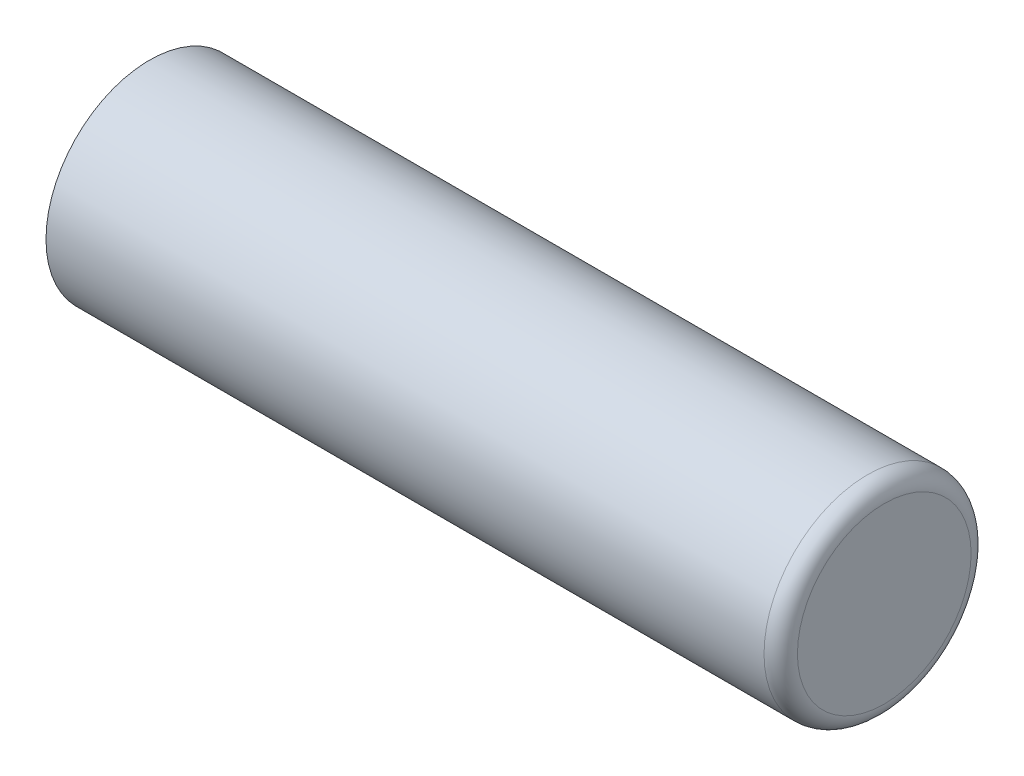
ISO-10303-21;
HEADER;
FILE_DESCRIPTION(('STEP AP214'),'2;1');
FILE_NAME('part.step','',(''),(''),'','','');
FILE_SCHEMA(('AUTOMOTIVE_DESIGN { 1 0 10303 214 1 1 1 1 }'));
ENDSEC;
DATA;
#1=APPLICATION_CONTEXT('core data for automotive mechanical design processes');
#2=APPLICATION_PROTOCOL_DEFINITION('international standard','automotive_design',2000,#1);
#3=PRODUCT_CONTEXT('',#1,'mechanical');
#4=PRODUCT('Part','Part','',(#3));
#5=PRODUCT_RELATED_PRODUCT_CATEGORY('part','',(#4));
#6=PRODUCT_DEFINITION_FORMATION('','',#4);
#7=PRODUCT_DEFINITION_CONTEXT('part definition',#1,'design');
#8=PRODUCT_DEFINITION('design','',#6,#7);
#9=PRODUCT_DEFINITION_SHAPE('','',#8);
#10=(LENGTH_UNIT() NAMED_UNIT(*) SI_UNIT(.MILLI.,.METRE.));
#11=(NAMED_UNIT(*) PLANE_ANGLE_UNIT() SI_UNIT($,.RADIAN.));
#12=(NAMED_UNIT(*) SI_UNIT($,.STERADIAN.) SOLID_ANGLE_UNIT());
#13=UNCERTAINTY_MEASURE_WITH_UNIT(LENGTH_MEASURE(1.E-05),#10,'distance_accuracy_value','');
#14=(GEOMETRIC_REPRESENTATION_CONTEXT(3) GLOBAL_UNCERTAINTY_ASSIGNED_CONTEXT((#13)) GLOBAL_UNIT_ASSIGNED_CONTEXT((#10,
#11,#12)) REPRESENTATION_CONTEXT('',''));
#15=CARTESIAN_POINT('',(0.,0.,0.));
#16=DIRECTION('',(0.,0.,1.));
#17=DIRECTION('',(1.,0.,0.));
#18=AXIS2_PLACEMENT_3D('',#15,#16,#17);
#19=CARTESIAN_POINT('',(11.,0.,-2.60000000000001));
#20=DIRECTION('',(-1.,0.,0.));
#21=DIRECTION('',(0.,0.,1.));
#22=AXIS2_PLACEMENT_3D('',#19,#20,#21);
#23=PLANE('',#22);
#24=CARTESIAN_POINT('',(11.,0.,0.));
#25=DIRECTION('',(-1.,0.,0.));
#26=DIRECTION('',(0.,0.,1.));
#27=AXIS2_PLACEMENT_3D('',#24,#25,#26);
#28=CIRCLE('',#27,2.60000000000001);
#29=CARTESIAN_POINT('',(11.,0.,2.60000000000001));
#30=VERTEX_POINT('',#29);
#31=EDGE_CURVE('E42',#30,#30,#28,.T.);
#32=ORIENTED_EDGE('',*,*,#31,.F.);
#33=EDGE_LOOP('',(#32));
#34=FACE_BOUND('',#33,.T.);
#35=ADVANCED_FACE('F32',(#34),#23,.F.);
#36=CARTESIAN_POINT('',(-11.,0.,-3.10000000000001));
#37=DIRECTION('',(1.,0.,0.));
#38=DIRECTION('',(0.,0.,-1.));
#39=AXIS2_PLACEMENT_3D('',#36,#37,#38);
#40=PLANE('',#39);
#41=CARTESIAN_POINT('',(-11.,0.,0.));
#42=DIRECTION('',(-1.,0.,0.));
#43=DIRECTION('',(0.,0.,1.));
#44=AXIS2_PLACEMENT_3D('',#41,#42,#43);
#45=CIRCLE('',#44,3.10000000000001);
#46=CARTESIAN_POINT('',(-11.,0.,3.10000000000001));
#47=VERTEX_POINT('',#46);
#48=EDGE_CURVE('E10',#47,#47,#45,.T.);
#49=ORIENTED_EDGE('',*,*,#48,.T.);
#50=EDGE_LOOP('',(#49));
#51=FACE_BOUND('',#50,.T.);
#52=ADVANCED_FACE('F52',(#51),#40,.F.);
#53=CARTESIAN_POINT('',(-11.,0.,0.));
#54=DIRECTION('',(-1.,0.,0.));
#55=DIRECTION('',(0.,0.,1.));
#56=AXIS2_PLACEMENT_3D('',#53,#54,#55);
#57=CYLINDRICAL_SURFACE('',#56,3.10000000000001);
#58=ORIENTED_EDGE('',*,*,#48,.F.);
#59=EDGE_LOOP('',(#58));
#60=FACE_BOUND('',#59,.T.);
#61=CARTESIAN_POINT('',(10.5,0.,0.));
#62=DIRECTION('',(-1.,0.,0.));
#63=DIRECTION('',(0.,0.,1.));
#64=AXIS2_PLACEMENT_3D('',#61,#62,#63);
#65=CIRCLE('',#64,3.10000000000001);
#66=CARTESIAN_POINT('',(10.5,0.,3.10000000000001));
#67=VERTEX_POINT('',#66);
#68=EDGE_CURVE('E38',#67,#67,#65,.T.);
#69=ORIENTED_EDGE('',*,*,#68,.T.);
#70=EDGE_LOOP('',(#69));
#71=FACE_BOUND('',#70,.T.);
#72=ADVANCED_FACE('F56',(#60,#71),#57,.T.);
#73=CARTESIAN_POINT('',(10.5,0.,0.));
#74=DIRECTION('',(-1.,0.,0.));
#75=DIRECTION('',(0.,0.,1.));
#76=AXIS2_PLACEMENT_3D('',#73,#74,#75);
#77=TOROIDAL_SURFACE('',#76,2.60000000000001,0.5);
#78=ORIENTED_EDGE('',*,*,#68,.F.);
#79=EDGE_LOOP('',(#78));
#80=FACE_BOUND('',#79,.T.);
#81=ORIENTED_EDGE('',*,*,#31,.T.);
#82=EDGE_LOOP('',(#81));
#83=FACE_BOUND('',#82,.T.);
#84=ADVANCED_FACE('F49',(#80,#83),#77,.T.);
#85=CLOSED_SHELL('',(#35,#52,#72,#84));
#86=MANIFOLD_SOLID_BREP('B2',#85);
#87=ADVANCED_BREP_SHAPE_REPRESENTATION('',(#18,#86),#14);
#88=SHAPE_DEFINITION_REPRESENTATION(#9,#87);
ENDSEC;
END-ISO-10303-21;
